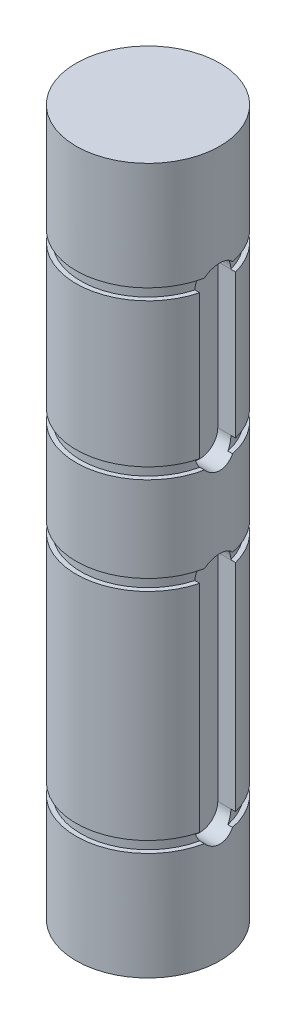
ISO-10303-21;
HEADER;
FILE_DESCRIPTION(('STEP AP214'),'2;1');
FILE_NAME('part.step','',(''),(''),'','','');
FILE_SCHEMA(('AUTOMOTIVE_DESIGN { 1 0 10303 214 1 1 1 1 }'));
ENDSEC;
DATA;
#1=APPLICATION_CONTEXT('core data for automotive mechanical design processes');
#2=APPLICATION_PROTOCOL_DEFINITION('international standard','automotive_design',2000,#1);
#3=PRODUCT_CONTEXT('',#1,'mechanical');
#4=PRODUCT('Part','Part','',(#3));
#5=PRODUCT_RELATED_PRODUCT_CATEGORY('part','',(#4));
#6=PRODUCT_DEFINITION_FORMATION('','',#4);
#7=PRODUCT_DEFINITION_CONTEXT('part definition',#1,'design');
#8=PRODUCT_DEFINITION('design','',#6,#7);
#9=PRODUCT_DEFINITION_SHAPE('','',#8);
#10=(LENGTH_UNIT() NAMED_UNIT(*) SI_UNIT(.MILLI.,.METRE.));
#11=(NAMED_UNIT(*) PLANE_ANGLE_UNIT() SI_UNIT($,.RADIAN.));
#12=(NAMED_UNIT(*) SI_UNIT($,.STERADIAN.) SOLID_ANGLE_UNIT());
#13=UNCERTAINTY_MEASURE_WITH_UNIT(LENGTH_MEASURE(1.E-05),#10,'distance_accuracy_value','');
#14=(GEOMETRIC_REPRESENTATION_CONTEXT(3) GLOBAL_UNCERTAINTY_ASSIGNED_CONTEXT((#13)) GLOBAL_UNIT_ASSIGNED_CONTEXT((#10,
#11,#12)) REPRESENTATION_CONTEXT('',''));
#15=CARTESIAN_POINT('',(0.,0.,0.));
#16=DIRECTION('',(0.,0.,1.));
#17=DIRECTION('',(1.,0.,0.));
#18=AXIS2_PLACEMENT_3D('',#15,#16,#17);
#19=CARTESIAN_POINT('',(0.,62.3062,0.));
#20=DIRECTION('',(0.,-1.,0.));
#21=DIRECTION('',(0.,0.,-1.));
#22=AXIS2_PLACEMENT_3D('',#19,#20,#21);
#23=CYLINDRICAL_SURFACE('',#22,6.35);
#24=CARTESIAN_POINT('',(0.,51.7906,0.));
#25=DIRECTION('',(0.,-1.,0.));
#26=DIRECTION('',(0.,0.,-1.));
#27=AXIS2_PLACEMENT_3D('',#24,#25,#26);
#28=CIRCLE('',#27,6.35);
#29=CARTESIAN_POINT('',(6.14836106210428,51.7906,1.5875));
#30=VERTEX_POINT('',#29);
#31=CARTESIAN_POINT('',(6.14836106210428,51.7906,-1.5875));
#32=VERTEX_POINT('',#31);
#33=EDGE_CURVE('E368',#30,#32,#28,.T.);
#34=ORIENTED_EDGE('',*,*,#33,.T.);
#35=DIRECTION('',(0.,-1.,0.));
#36=VECTOR('',#35,1.);
#37=CARTESIAN_POINT('',(6.14836106210428,62.3062,-1.5875));
#38=LINE('',#37,#36);
#39=CARTESIAN_POINT('',(6.14836106210428,39.0906,-1.5875));
#40=VERTEX_POINT('',#39);
#41=EDGE_CURVE('E677',#32,#40,#38,.T.);
#42=ORIENTED_EDGE('',*,*,#41,.T.);
#43=CARTESIAN_POINT('',(0.,39.0906,0.));
#44=DIRECTION('',(0.,1.,0.));
#45=DIRECTION('',(0.,0.,1.));
#46=AXIS2_PLACEMENT_3D('',#43,#44,#45);
#47=CIRCLE('',#46,6.35);
#48=CARTESIAN_POINT('',(6.14836106210428,39.0906,1.5875));
#49=VERTEX_POINT('',#48);
#50=EDGE_CURVE('E364',#40,#49,#47,.T.);
#51=ORIENTED_EDGE('',*,*,#50,.T.);
#52=DIRECTION('',(0.,-1.,0.));
#53=VECTOR('',#52,1.);
#54=CARTESIAN_POINT('',(6.14836106210428,62.3062,1.5875));
#55=LINE('',#54,#53);
#56=EDGE_CURVE('E679',#49,#30,#55,.F.);
#57=ORIENTED_EDGE('',*,*,#56,.T.);
#58=EDGE_LOOP('',(#34,#42,#51,#57));
#59=FACE_BOUND('',#58,.T.);
#60=ADVANCED_FACE('F32',(#59),#23,.T.);
#61=CARTESIAN_POINT('',(0.,51.7906,30.9495405489973));
#62=DIRECTION('',(0.,-1.,0.));
#63=DIRECTION('',(0.,0.,-1.));
#64=AXIS2_PLACEMENT_3D('',#61,#62,#63);
#65=PLANE('',#64);
#66=CARTESIAN_POINT('',(0.,51.7906,0.));
#67=DIRECTION('',(0.,1.,0.));
#68=DIRECTION('',(0.,0.,1.));
#69=AXIS2_PLACEMENT_3D('',#66,#67,#68);
#70=CIRCLE('',#69,5.9436);
#71=CARTESIAN_POINT('',(5.72767184028555,51.7906,-1.5875));
#72=VERTEX_POINT('',#71);
#73=CARTESIAN_POINT('',(5.72767184028555,51.7906,1.5875));
#74=VERTEX_POINT('',#73);
#75=EDGE_CURVE('E375',#72,#74,#70,.T.);
#76=ORIENTED_EDGE('',*,*,#75,.F.);
#77=DIRECTION('',(1.,0.,0.));
#78=VECTOR('',#77,1.);
#79=CARTESIAN_POINT('',(4.572,51.7906,-1.5875));
#80=LINE('',#79,#78);
#81=EDGE_CURVE('E297',#72,#32,#80,.T.);
#82=ORIENTED_EDGE('',*,*,#81,.T.);
#83=ORIENTED_EDGE('',*,*,#33,.F.);
#84=DIRECTION('',(1.,0.,0.));
#85=VECTOR('',#84,1.);
#86=CARTESIAN_POINT('',(4.572,51.7906,1.5875));
#87=LINE('',#86,#85);
#88=EDGE_CURVE('E293',#74,#30,#87,.T.);
#89=ORIENTED_EDGE('',*,*,#88,.F.);
#90=EDGE_LOOP('',(#76,#82,#83,#89));
#91=FACE_BOUND('',#90,.T.);
#92=ADVANCED_FACE('F434',(#91),#65,.F.);
#93=CARTESIAN_POINT('',(0.,52.7812,30.9495405489973));
#94=DIRECTION('',(0.,1.,0.));
#95=DIRECTION('',(0.,0.,1.));
#96=AXIS2_PLACEMENT_3D('',#93,#94,#95);
#97=PLANE('',#96);
#98=CARTESIAN_POINT('',(0.,52.7812,0.));
#99=DIRECTION('',(0.,1.,0.));
#100=DIRECTION('',(0.,0.,1.));
#101=AXIS2_PLACEMENT_3D('',#98,#99,#100);
#102=CIRCLE('',#101,5.9436);
#103=CARTESIAN_POINT('',(5.81270273366874,52.7812,-1.24051114061906));
#104=VERTEX_POINT('',#103);
#105=CARTESIAN_POINT('',(5.81270273366874,52.7812,1.24051114061906));
#106=VERTEX_POINT('',#105);
#107=EDGE_CURVE('E363',#104,#106,#102,.T.);
#108=ORIENTED_EDGE('',*,*,#107,.T.);
#109=DIRECTION('',(1.,0.,0.));
#110=VECTOR('',#109,1.);
#111=CARTESIAN_POINT('',(4.572,52.7812,1.24051114061906));
#112=LINE('',#111,#110);
#113=CARTESIAN_POINT('',(6.22765060917839,52.7812,1.24051114061906));
#114=VERTEX_POINT('',#113);
#115=EDGE_CURVE('E666',#106,#114,#112,.T.);
#116=ORIENTED_EDGE('',*,*,#115,.T.);
#117=CARTESIAN_POINT('',(0.,52.7812,0.));
#118=DIRECTION('',(0.,1.,0.));
#119=DIRECTION('',(0.,0.,1.));
#120=AXIS2_PLACEMENT_3D('',#117,#118,#119);
#121=CIRCLE('',#120,6.35);
#122=CARTESIAN_POINT('',(6.22765060917839,52.7812,-1.24051114061906));
#123=VERTEX_POINT('',#122);
#124=EDGE_CURVE('E372',#123,#114,#121,.T.);
#125=ORIENTED_EDGE('',*,*,#124,.F.);
#126=DIRECTION('',(1.,0.,0.));
#127=VECTOR('',#126,1.);
#128=CARTESIAN_POINT('',(4.572,52.7812,-1.24051114061906));
#129=LINE('',#128,#127);
#130=EDGE_CURVE('E667',#123,#104,#129,.F.);
#131=ORIENTED_EDGE('',*,*,#130,.T.);
#132=EDGE_LOOP('',(#108,#116,#125,#131));
#133=FACE_BOUND('',#132,.T.);
#134=ADVANCED_FACE('F440',(#133),#97,.F.);
#135=CARTESIAN_POINT('',(0.,57.3479735584588,0.));
#136=DIRECTION('',(0.,1.,0.));
#137=DIRECTION('',(0.,0.,1.));
#138=AXIS2_PLACEMENT_3D('',#135,#136,#137);
#139=CYLINDRICAL_SURFACE('',#138,5.9436);
#140=ORIENTED_EDGE('',*,*,#75,.T.);
#141=CARTESIAN_POINT('',(5.72767184028555,51.7906,1.5875));
#142=CARTESIAN_POINT('',(5.72766804610027,51.8349788866214,1.58750194805808));
#143=CARTESIAN_POINT('',(5.72818813422054,51.8793382686311,1.58563830137082));
#144=CARTESIAN_POINT('',(5.73024000478097,51.967712391909,1.57821195212509));
#145=CARTESIAN_POINT('',(5.73177154850907,52.0117272120172,1.57265012236694));
#146=CARTESIAN_POINT('',(5.73771384551916,52.1403217209515,1.55088835422927));
#147=CARTESIAN_POINT('',(5.74347777277273,52.2240289517323,1.52960258418085));
#148=CARTESIAN_POINT('',(5.75836292111803,52.3903481785974,1.47259415694831));
#149=CARTESIAN_POINT('',(5.76762462415825,52.4727380974612,1.43626019797557));
#150=CARTESIAN_POINT('',(5.78329806159334,52.5918087718749,1.37126100174845));
#151=CARTESIAN_POINT('',(5.78891663315768,52.6312960658287,1.34740876355262));
#152=CARTESIAN_POINT('',(5.80055334186276,52.7080038913665,1.29639711833931));
#153=CARTESIAN_POINT('',(5.80657142646175,52.7452247197941,1.26923814581491));
#154=CARTESIAN_POINT('',(5.81270273366874,52.7812,1.24051114061906));
#155=B_SPLINE_CURVE_WITH_KNOTS('',3,(#141,#142,#143,#144,#145,#146,#147,#148,#149,#150,#151,
#152,#153,#154),.UNSPECIFIED.,.F.,.F.,(4,2,2,2,2,2,4),(0.,0.13305635000978,0.266081308813883,
0.524501760701662,0.794649138064695,0.933915485774882,1.07316355409293),.UNSPECIFIED.);
#156=EDGE_CURVE('E397',#74,#106,#155,.T.);
#157=ORIENTED_EDGE('',*,*,#156,.T.);
#158=ORIENTED_EDGE('',*,*,#107,.F.);
#159=CARTESIAN_POINT('',(5.81270273366874,52.7812,-1.24051114061906));
#160=CARTESIAN_POINT('',(5.80676093223229,52.74633733761,-1.26835031027519));
#161=CARTESIAN_POINT('',(5.8009253407225,52.7103032972455,-1.29471734166642));
#162=CARTESIAN_POINT('',(5.78962448943313,52.636101088542,-1.34435038702208));
#163=CARTESIAN_POINT('',(5.78415925642407,52.5979327662943,-1.36761617693749));
#164=CARTESIAN_POINT('',(5.76886044428707,52.4828281402528,-1.43125963250244));
#165=CARTESIAN_POINT('',(5.75975979338478,52.403231861975,-1.46711930717738));
#166=CARTESIAN_POINT('',(5.74448324543573,52.2375483974185,-1.52585859113951));
#167=CARTESIAN_POINT('',(5.73835992335598,52.151373607262,-1.54850619216327));
#168=CARTESIAN_POINT('',(5.73203917642506,52.0188296974734,-1.57167662157916));
#169=CARTESIAN_POINT('',(5.73040804690453,51.9734147554939,-1.57760264372825));
#170=CARTESIAN_POINT('',(5.72822216727329,51.8822074368184,-1.58551566901053));
#171=CARTESIAN_POINT('',(5.72766765395878,51.8364149793135,-1.58750180558824));
#172=CARTESIAN_POINT('',(5.72767184028555,51.7906,-1.5875));
#173=B_SPLINE_CURVE_WITH_KNOTS('',3,(#159,#160,#161,#162,#163,#164,#165,#166,#167,#168,#169,
#170,#171,#172),.UNSPECIFIED.,.F.,.F.,(4,2,2,2,2,2,4),(0.,0.13494965007682,0.269909044305552,
0.531960547427966,0.798485077464079,0.935809383428473,1.07316388974744),.UNSPECIFIED.);
#174=EDGE_CURVE('E404',#104,#72,#173,.T.);
#175=ORIENTED_EDGE('',*,*,#174,.T.);
#176=EDGE_LOOP('',(#140,#157,#158,#175));
#177=FACE_BOUND('',#176,.T.);
#178=ADVANCED_FACE('F409',(#177),#139,.T.);
#179=CARTESIAN_POINT('',(0.,62.3062,0.));
#180=DIRECTION('',(0.,1.,0.));
#181=DIRECTION('',(0.,0.,1.));
#182=AXIS2_PLACEMENT_3D('',#179,#180,#181);
#183=PLANE('',#182);
#184=CARTESIAN_POINT('',(0.,62.3062,0.));
#185=DIRECTION('',(0.,1.,0.));
#186=DIRECTION('',(0.,0.,1.));
#187=AXIS2_PLACEMENT_3D('',#184,#185,#186);
#188=CIRCLE('',#187,6.35);
#189=CARTESIAN_POINT('',(0.,62.3062,6.35));
#190=VERTEX_POINT('',#189);
#191=EDGE_CURVE('E343',#190,#190,#188,.T.);
#192=ORIENTED_EDGE('',*,*,#191,.T.);
#193=EDGE_LOOP('',(#192));
#194=FACE_BOUND('',#193,.T.);
#195=ADVANCED_FACE('F444',(#194),#183,.T.);
#196=ORIENTED_EDGE('',*,*,#124,.T.);
#197=CARTESIAN_POINT('',(6.22765060917839,52.7812,1.24051114061906));
#198=CARTESIAN_POINT('',(6.23320783945382,52.8161378215592,1.2126102393573));
#199=CARTESIAN_POINT('',(6.23886039060933,52.8498712636352,1.18325559981259));
#200=CARTESIAN_POINT('',(6.25020149422038,52.914741606585,1.12181126216662));
#201=CARTESIAN_POINT('',(6.25589004691655,52.9458784900839,1.08972154576646));
#202=CARTESIAN_POINT('',(6.2727722846694,53.0350837099081,0.989640681923259));
#203=CARTESIAN_POINT('',(6.28378811857192,53.0889801382244,0.917811004237603));
#204=CARTESIAN_POINT('',(6.3041083179383,53.1840151207872,0.76589422656221));
#205=CARTESIAN_POINT('',(6.31341126157692,53.22514309553,0.685800351954511));
#206=CARTESIAN_POINT('',(6.32925406928647,53.2933365380244,0.519609689028027));
#207=CARTESIAN_POINT('',(6.33579564411446,53.3204107149522,0.433516656017836));
#208=CARTESIAN_POINT('',(6.34529454604823,53.3592846308184,0.259270320083067));
#209=CARTESIAN_POINT('',(6.34830987825246,53.3713317849185,0.171175393891068));
#210=CARTESIAN_POINT('',(6.35061397512241,53.3805608892268,-0.00584854805473896));
#211=CARTESIAN_POINT('',(6.34990259861925,53.377742276315,-0.0947775952779393));
#212=CARTESIAN_POINT('',(6.34488868818956,53.3575583908652,-0.268922050286359));
#213=CARTESIAN_POINT('',(6.34066327595629,53.340505485485,-0.354176205390172));
#214=CARTESIAN_POINT('',(6.32917385599744,53.2928081997939,-0.520596366331578));
#215=CARTESIAN_POINT('',(6.32190904766935,53.2621602383026,-0.601761288714857));
#216=CARTESIAN_POINT('',(6.30501409455029,53.1878048506769,-0.75868455861302));
#217=CARTESIAN_POINT('',(6.2953588178793,53.1439575225197,-0.834373638215742));
#218=CARTESIAN_POINT('',(6.27474734999086,53.0445771479035,-0.977374398357573));
#219=CARTESIAN_POINT('',(6.26379263841329,52.98905733804,-1.04469543181984));
#220=CARTESIAN_POINT('',(6.24855866645397,52.9053466372952,-1.13075323727132));
#221=CARTESIAN_POINT('',(6.24433654135724,52.8814629829803,-1.15381013700283));
#222=CARTESIAN_POINT('',(6.23594250238016,52.8323387160929,-1.19834525875783));
#223=CARTESIAN_POINT('',(6.2317705110774,52.8071006532646,-1.21982627860311));
#224=CARTESIAN_POINT('',(6.22765060917839,52.7812,-1.24051114061906));
#225=B_SPLINE_CURVE_WITH_KNOTS('',3,(#197,#198,#199,#200,#201,#202,#203,#204,#205,#206,#207,
#208,#209,#210,#211,#212,#213,#214,#215,#216,#217,#218,#219,#220,#221,#222,#223,#224),
.UNSPECIFIED.,.F.,.F.,(4,2,2,2,2,2,2,2,2,2,2,2,2,4),(0.,0.13508328392132,0.270167471681551,
0.540207610771843,0.810470902383514,1.08056651055367,1.34615372554164,1.61175100112949,
1.87166851811821,2.13165454271635,2.39449949657434,2.65704797661509,2.75739135215893,
2.8575520354902),.UNSPECIFIED.);
#226=EDGE_CURVE('E248',#114,#123,#225,.T.);
#227=ORIENTED_EDGE('',*,*,#226,.T.);
#228=EDGE_LOOP('',(#196,#227));
#229=FACE_BOUND('',#228,.T.);
#230=ORIENTED_EDGE('',*,*,#191,.F.);
#231=EDGE_LOOP('',(#230));
#232=FACE_BOUND('',#231,.T.);
#233=ADVANCED_FACE('F34',(#229,#232),#23,.T.);
#234=CARTESIAN_POINT('',(0.,38.1,29.4897754611827));
#235=DIRECTION('',(0.,-1.,0.));
#236=DIRECTION('',(0.,0.,-1.));
#237=AXIS2_PLACEMENT_3D('',#234,#235,#236);
#238=PLANE('',#237);
#239=CARTESIAN_POINT('',(0.,38.1,0.));
#240=DIRECTION('',(0.,1.,0.));
#241=DIRECTION('',(0.,0.,1.));
#242=AXIS2_PLACEMENT_3D('',#239,#240,#241);
#243=CIRCLE('',#242,5.9436);
#244=CARTESIAN_POINT('',(5.81270273366874,38.1,-1.24051114061906));
#245=VERTEX_POINT('',#244);
#246=CARTESIAN_POINT('',(5.81270273366874,38.1,1.24051114061906));
#247=VERTEX_POINT('',#246);
#248=EDGE_CURVE('E367',#245,#247,#243,.T.);
#249=ORIENTED_EDGE('',*,*,#248,.F.);
#250=DIRECTION('',(1.,0.,0.));
#251=VECTOR('',#250,1.);
#252=CARTESIAN_POINT('',(4.572,38.1,-1.24051114061906));
#253=LINE('',#252,#251);
#254=CARTESIAN_POINT('',(6.22765060917839,38.1,-1.24051114061906));
#255=VERTEX_POINT('',#254);
#256=EDGE_CURVE('E310',#245,#255,#253,.T.);
#257=ORIENTED_EDGE('',*,*,#256,.T.);
#258=CARTESIAN_POINT('',(0.,38.1,0.));
#259=DIRECTION('',(0.,-1.,0.));
#260=DIRECTION('',(0.,0.,-1.));
#261=AXIS2_PLACEMENT_3D('',#258,#259,#260);
#262=CIRCLE('',#261,6.35);
#263=CARTESIAN_POINT('',(6.22765060917839,38.1,1.24051114061906));
#264=VERTEX_POINT('',#263);
#265=EDGE_CURVE('E360',#264,#255,#262,.T.);
#266=ORIENTED_EDGE('',*,*,#265,.F.);
#267=DIRECTION('',(1.,0.,0.));
#268=VECTOR('',#267,1.);
#269=CARTESIAN_POINT('',(4.572,38.1,1.24051114061906));
#270=LINE('',#269,#268);
#271=EDGE_CURVE('E61',#264,#247,#270,.F.);
#272=ORIENTED_EDGE('',*,*,#271,.T.);
#273=EDGE_LOOP('',(#249,#257,#266,#272));
#274=FACE_BOUND('',#273,.T.);
#275=ADVANCED_FACE('F443',(#274),#238,.F.);
#276=CARTESIAN_POINT('',(0.,39.0906,29.4897754611827));
#277=DIRECTION('',(0.,1.,0.));
#278=DIRECTION('',(0.,0.,1.));
#279=AXIS2_PLACEMENT_3D('',#276,#277,#278);
#280=PLANE('',#279);
#281=ORIENTED_EDGE('',*,*,#50,.F.);
#282=DIRECTION('',(1.,0.,0.));
#283=VECTOR('',#282,1.);
#284=CARTESIAN_POINT('',(4.572,39.0906,-1.5875));
#285=LINE('',#284,#283);
#286=CARTESIAN_POINT('',(5.72767184028555,39.0906,-1.5875));
#287=VERTEX_POINT('',#286);
#288=EDGE_CURVE('E301',#287,#40,#285,.T.);
#289=ORIENTED_EDGE('',*,*,#288,.F.);
#290=CARTESIAN_POINT('',(0.,39.0906,0.));
#291=DIRECTION('',(0.,1.,0.));
#292=DIRECTION('',(0.,0.,1.));
#293=AXIS2_PLACEMENT_3D('',#290,#291,#292);
#294=CIRCLE('',#293,5.9436);
#295=CARTESIAN_POINT('',(5.72767184028555,39.0906,1.5875));
#296=VERTEX_POINT('',#295);
#297=EDGE_CURVE('E355',#287,#296,#294,.T.);
#298=ORIENTED_EDGE('',*,*,#297,.T.);
#299=DIRECTION('',(1.,0.,0.));
#300=VECTOR('',#299,1.);
#301=CARTESIAN_POINT('',(4.572,39.0906,1.5875));
#302=LINE('',#301,#300);
#303=EDGE_CURVE('E305',#296,#49,#302,.T.);
#304=ORIENTED_EDGE('',*,*,#303,.T.);
#305=EDGE_LOOP('',(#281,#289,#298,#304));
#306=FACE_BOUND('',#305,.T.);
#307=ADVANCED_FACE('F455',(#306),#280,.F.);
#308=CARTESIAN_POINT('',(0.,44.8930496120412,0.));
#309=DIRECTION('',(0.,1.,0.));
#310=DIRECTION('',(0.,0.,1.));
#311=AXIS2_PLACEMENT_3D('',#308,#309,#310);
#312=CYLINDRICAL_SURFACE('',#311,5.9436);
#313=ORIENTED_EDGE('',*,*,#248,.T.);
#314=CARTESIAN_POINT('',(5.81270273366874,38.1,1.24051114061906));
#315=CARTESIAN_POINT('',(5.80676093223229,38.13486266239,1.26835031027519));
#316=CARTESIAN_POINT('',(5.8009253407225,38.1708967027545,1.29471734166642));
#317=CARTESIAN_POINT('',(5.78962448943313,38.245098911458,1.34435038702208));
#318=CARTESIAN_POINT('',(5.78415925642407,38.2832672337057,1.36761617693749));
#319=CARTESIAN_POINT('',(5.76886044428707,38.3983718597472,1.43125963250244));
#320=CARTESIAN_POINT('',(5.75975979338478,38.477968138025,1.46711930717738));
#321=CARTESIAN_POINT('',(5.74448324543573,38.6436516025815,1.52585859113951));
#322=CARTESIAN_POINT('',(5.73835992335598,38.7298263927379,1.54850619216327));
#323=CARTESIAN_POINT('',(5.73203917642507,38.8623703025266,1.57167662157916));
#324=CARTESIAN_POINT('',(5.73040804690453,38.9077852445061,1.57760264372825));
#325=CARTESIAN_POINT('',(5.72822216727329,38.9989925631815,1.58551566901053));
#326=CARTESIAN_POINT('',(5.72766765395878,39.0447850206865,1.58750180558824));
#327=CARTESIAN_POINT('',(5.72767184028555,39.0906,1.5875));
#328=B_SPLINE_CURVE_WITH_KNOTS('',3,(#314,#315,#316,#317,#318,#319,#320,#321,#322,#323,#324,
#325,#326,#327),.UNSPECIFIED.,.F.,.F.,(4,2,2,2,2,2,4),(0.,0.13494965007682,0.269909044305552,
0.531960547427966,0.798485077464079,0.935809383428466,1.07316388974744),.UNSPECIFIED.);
#329=EDGE_CURVE('E321',#247,#296,#328,.T.);
#330=ORIENTED_EDGE('',*,*,#329,.T.);
#331=ORIENTED_EDGE('',*,*,#297,.F.);
#332=CARTESIAN_POINT('',(5.72767184028555,39.0906,-1.5875));
#333=CARTESIAN_POINT('',(5.72766804610027,39.0462211133786,-1.58750194805808));
#334=CARTESIAN_POINT('',(5.72818813422054,39.0018617313689,-1.58563830137082));
#335=CARTESIAN_POINT('',(5.73024000478097,38.913487608091,-1.57821195212509));
#336=CARTESIAN_POINT('',(5.73177154850907,38.8694727879827,-1.57265012236694));
#337=CARTESIAN_POINT('',(5.73771384551916,38.7408782790485,-1.55088835422927));
#338=CARTESIAN_POINT('',(5.74347777277273,38.6571710482677,-1.52960258418085));
#339=CARTESIAN_POINT('',(5.75836292111803,38.4908518214025,-1.47259415694831));
#340=CARTESIAN_POINT('',(5.76762462415825,38.4084619025388,-1.43626019797557));
#341=CARTESIAN_POINT('',(5.78329806159334,38.2893912281251,-1.37126100174845));
#342=CARTESIAN_POINT('',(5.78891663315769,38.2499039341713,-1.34740876355262));
#343=CARTESIAN_POINT('',(5.80055334186276,38.1731961086335,-1.29639711833931));
#344=CARTESIAN_POINT('',(5.80657142646176,38.1359752802059,-1.26923814581491));
#345=CARTESIAN_POINT('',(5.81270273366874,38.1,-1.24051114061906));
#346=B_SPLINE_CURVE_WITH_KNOTS('',3,(#332,#333,#334,#335,#336,#337,#338,#339,#340,#341,#342,
#343,#344,#345),.UNSPECIFIED.,.F.,.F.,(4,2,2,2,2,2,4),(0.,0.13305635000978,0.266081308813883,
0.524501760701662,0.794649138064695,0.933915485774882,1.07316355409293),.UNSPECIFIED.);
#347=EDGE_CURVE('E313',#287,#245,#346,.T.);
#348=ORIENTED_EDGE('',*,*,#347,.T.);
#349=EDGE_LOOP('',(#313,#330,#331,#348));
#350=FACE_BOUND('',#349,.T.);
#351=ADVANCED_FACE('F326',(#350),#312,.T.);
#352=CARTESIAN_POINT('',(0.,30.5562,0.));
#353=DIRECTION('',(0.,1.,0.));
#354=DIRECTION('',(0.,0.,1.));
#355=AXIS2_PLACEMENT_3D('',#352,#353,#354);
#356=CIRCLE('',#355,6.35);
#357=CARTESIAN_POINT('',(6.2276506091784,30.5562,-1.24051114061906));
#358=VERTEX_POINT('',#357);
#359=CARTESIAN_POINT('',(6.2276506091784,30.5562,1.24051114061905));
#360=VERTEX_POINT('',#359);
#361=EDGE_CURVE('E356',#358,#360,#356,.T.);
#362=ORIENTED_EDGE('',*,*,#361,.T.);
#363=CARTESIAN_POINT('',(6.2276506091784,30.5562,1.24051114061905));
#364=CARTESIAN_POINT('',(6.23320783945382,30.5911378215592,1.21261023935729));
#365=CARTESIAN_POINT('',(6.23886039060933,30.6248712636352,1.18325559981258));
#366=CARTESIAN_POINT('',(6.25020149422039,30.689741606585,1.12181126216661));
#367=CARTESIAN_POINT('',(6.25589004691655,30.7208784900839,1.08972154576645));
#368=CARTESIAN_POINT('',(6.2727722846694,30.8100837099081,0.989640681923253));
#369=CARTESIAN_POINT('',(6.28378811857192,30.8639801382244,0.917811004237598));
#370=CARTESIAN_POINT('',(6.3041083179383,30.9590151207872,0.765894226562205));
#371=CARTESIAN_POINT('',(6.31341126157692,31.00014309553,0.685800351954505));
#372=CARTESIAN_POINT('',(6.32925406928647,31.0683365380244,0.519609689028021));
#373=CARTESIAN_POINT('',(6.33579564411446,31.0954107149522,0.43351665601783));
#374=CARTESIAN_POINT('',(6.34529454604823,31.1342846308184,0.259270320083061));
#375=CARTESIAN_POINT('',(6.34830987825246,31.1463317849185,0.171175393891061));
#376=CARTESIAN_POINT('',(6.35061397512241,31.1555608892268,-0.00584854805474554));
#377=CARTESIAN_POINT('',(6.34990259861925,31.152742276315,-0.0947775952779453));
#378=CARTESIAN_POINT('',(6.34488868818956,31.1325583908652,-0.268922050286364));
#379=CARTESIAN_POINT('',(6.3406632759563,31.115505485485,-0.354176205390177));
#380=CARTESIAN_POINT('',(6.32917385599744,31.0678081997939,-0.520596366331583));
#381=CARTESIAN_POINT('',(6.32190904766935,31.0371602383026,-0.601761288714861));
#382=CARTESIAN_POINT('',(6.30501409455029,30.9628048506769,-0.758684558613023));
#383=CARTESIAN_POINT('',(6.2953588178793,30.9189575225197,-0.834373638215743));
#384=CARTESIAN_POINT('',(6.27474734999086,30.8195771479035,-0.977374398357576));
#385=CARTESIAN_POINT('',(6.26379263841329,30.76405733804,-1.04469543181985));
#386=CARTESIAN_POINT('',(6.24855866645397,30.6803466372952,-1.13075323727132));
#387=CARTESIAN_POINT('',(6.24433654135724,30.6564629829803,-1.15381013700283));
#388=CARTESIAN_POINT('',(6.23594250238016,30.6073387160929,-1.19834525875782));
#389=CARTESIAN_POINT('',(6.23177051107741,30.5821006532646,-1.21982627860311));
#390=CARTESIAN_POINT('',(6.2276506091784,30.5562,-1.24051114061905));
#391=B_SPLINE_CURVE_WITH_KNOTS('',3,(#363,#364,#365,#366,#367,#368,#369,#370,#371,#372,#373,
#374,#375,#376,#377,#378,#379,#380,#381,#382,#383,#384,#385,#386,#387,#388,#389,#390),
.UNSPECIFIED.,.F.,.F.,(4,2,2,2,2,2,2,2,2,2,2,2,2,4),(0.,0.13508328392132,0.270167471681552,
0.54020761077184,0.810470902383512,1.08056651055366,1.34615372554164,1.61175100112949,
1.8716685181182,2.13165454271634,2.39449949657433,2.65704797661508,2.75739135215892,
2.85755203549018),.UNSPECIFIED.);
#392=EDGE_CURVE('E270',#360,#358,#391,.T.);
#393=ORIENTED_EDGE('',*,*,#392,.T.);
#394=EDGE_LOOP('',(#362,#393));
#395=FACE_BOUND('',#394,.T.);
#396=ORIENTED_EDGE('',*,*,#265,.T.);
#397=CARTESIAN_POINT('',(6.22765060917839,38.1,-1.24051114061906));
#398=CARTESIAN_POINT('',(6.23320783945382,38.0650621784408,-1.2126102393573));
#399=CARTESIAN_POINT('',(6.23886039060933,38.0313287363647,-1.18325559981259));
#400=CARTESIAN_POINT('',(6.25020149422038,37.9664583934149,-1.12181126216662));
#401=CARTESIAN_POINT('',(6.25589004691655,37.9353215099161,-1.08972154576646));
#402=CARTESIAN_POINT('',(6.2727722846694,37.8461162900919,-0.989640681923259));
#403=CARTESIAN_POINT('',(6.28378811857192,37.7922198617755,-0.917811004237603));
#404=CARTESIAN_POINT('',(6.3041083179383,37.6971848792128,-0.76589422656221));
#405=CARTESIAN_POINT('',(6.31341126157692,37.6560569044699,-0.685800351954511));
#406=CARTESIAN_POINT('',(6.32925406928647,37.5878634619756,-0.519609689028027));
#407=CARTESIAN_POINT('',(6.33579564411446,37.5607892850477,-0.433516656017836));
#408=CARTESIAN_POINT('',(6.34529454604823,37.5219153691816,-0.259270320083067));
#409=CARTESIAN_POINT('',(6.34830987825246,37.5098682150815,-0.171175393891068));
#410=CARTESIAN_POINT('',(6.35061397512241,37.5006391107732,0.00584854805473896));
#411=CARTESIAN_POINT('',(6.34990259861925,37.503457723685,0.0947775952779393));
#412=CARTESIAN_POINT('',(6.34488868818956,37.5236416091347,0.268922050286359));
#413=CARTESIAN_POINT('',(6.34066327595629,37.540694514515,0.354176205390172));
#414=CARTESIAN_POINT('',(6.32917385599744,37.5883918002061,0.520596366331578));
#415=CARTESIAN_POINT('',(6.32190904766935,37.6190397616974,0.601761288714857));
#416=CARTESIAN_POINT('',(6.30501409455029,37.6933951493231,0.75868455861302));
#417=CARTESIAN_POINT('',(6.2953588178793,37.7372424774803,0.834373638215742));
#418=CARTESIAN_POINT('',(6.27474734999086,37.8366228520964,0.977374398357573));
#419=CARTESIAN_POINT('',(6.26379263841329,37.89214266196,1.04469543181984));
#420=CARTESIAN_POINT('',(6.24855866645397,37.9758533627048,1.13075323727132));
#421=CARTESIAN_POINT('',(6.24433654135724,37.9997370170197,1.15381013700283));
#422=CARTESIAN_POINT('',(6.23594250238016,38.0488612839071,1.19834525875783));
#423=CARTESIAN_POINT('',(6.2317705110774,38.0740993467353,1.21982627860311));
#424=CARTESIAN_POINT('',(6.22765060917839,38.1,1.24051114061906));
#425=B_SPLINE_CURVE_WITH_KNOTS('',3,(#397,#398,#399,#400,#401,#402,#403,#404,#405,#406,#407,
#408,#409,#410,#411,#412,#413,#414,#415,#416,#417,#418,#419,#420,#421,#422,#423,#424),
.UNSPECIFIED.,.F.,.F.,(4,2,2,2,2,2,2,2,2,2,2,2,2,4),(0.,0.13508328392132,0.270167471681551,
0.540207610771843,0.810470902383514,1.08056651055367,1.34615372554164,1.61175100112949,
1.87166851811821,2.13165454271635,2.39449949657434,2.65704797661509,2.75739135215893,
2.8575520354902),.UNSPECIFIED.);
#426=EDGE_CURVE('E338',#255,#264,#425,.T.);
#427=ORIENTED_EDGE('',*,*,#426,.T.);
#428=EDGE_LOOP('',(#396,#427));
#429=FACE_BOUND('',#428,.T.);
#430=ADVANCED_FACE('F436',(#395,#429),#23,.T.);
#431=CARTESIAN_POINT('',(0.,29.5656,24.6019803533965));
#432=DIRECTION('',(0.,-1.,0.));
#433=DIRECTION('',(0.,0.,-1.));
#434=AXIS2_PLACEMENT_3D('',#431,#432,#433);
#435=PLANE('',#434);
#436=CARTESIAN_POINT('',(0.,29.5656,0.));
#437=DIRECTION('',(0.,1.,0.));
#438=DIRECTION('',(0.,0.,1.));
#439=AXIS2_PLACEMENT_3D('',#436,#437,#438);
#440=CIRCLE('',#439,5.9436);
#441=CARTESIAN_POINT('',(5.72767184028555,29.5656,-1.5875));
#442=VERTEX_POINT('',#441);
#443=CARTESIAN_POINT('',(5.72767184028555,29.5656,1.5875));
#444=VERTEX_POINT('',#443);
#445=EDGE_CURVE('E359',#442,#444,#440,.T.);
#446=ORIENTED_EDGE('',*,*,#445,.F.);
#447=DIRECTION('',(1.,0.,0.));
#448=VECTOR('',#447,1.);
#449=CARTESIAN_POINT('',(4.572,29.5656,-1.5875));
#450=LINE('',#449,#448);
#451=CARTESIAN_POINT('',(6.14836106210428,29.5656,-1.5875));
#452=VERTEX_POINT('',#451);
#453=EDGE_CURVE('E206',#442,#452,#450,.T.);
#454=ORIENTED_EDGE('',*,*,#453,.T.);
#455=CARTESIAN_POINT('',(0.,29.5656,0.));
#456=DIRECTION('',(0.,-1.,0.));
#457=DIRECTION('',(0.,0.,-1.));
#458=AXIS2_PLACEMENT_3D('',#455,#456,#457);
#459=CIRCLE('',#458,6.35);
#460=CARTESIAN_POINT('',(6.14836106210428,29.5656,1.5875));
#461=VERTEX_POINT('',#460);
#462=EDGE_CURVE('E352',#461,#452,#459,.T.);
#463=ORIENTED_EDGE('',*,*,#462,.F.);
#464=DIRECTION('',(1.,0.,0.));
#465=VECTOR('',#464,1.);
#466=CARTESIAN_POINT('',(4.572,29.5656,1.5875));
#467=LINE('',#466,#465);
#468=EDGE_CURVE('E185',#444,#461,#467,.T.);
#469=ORIENTED_EDGE('',*,*,#468,.F.);
#470=EDGE_LOOP('',(#446,#454,#463,#469));
#471=FACE_BOUND('',#470,.T.);
#472=ADVANCED_FACE('F447',(#471),#435,.F.);
#473=CARTESIAN_POINT('',(0.,30.5562,24.6019803533965));
#474=DIRECTION('',(0.,1.,0.));
#475=DIRECTION('',(0.,0.,1.));
#476=AXIS2_PLACEMENT_3D('',#473,#474,#475);
#477=PLANE('',#476);
#478=CARTESIAN_POINT('',(0.,30.5562,0.));
#479=DIRECTION('',(0.,1.,0.));
#480=DIRECTION('',(0.,0.,1.));
#481=AXIS2_PLACEMENT_3D('',#478,#479,#480);
#482=CIRCLE('',#481,5.9436);
#483=CARTESIAN_POINT('',(5.81270273366874,30.5562,-1.24051114061906));
#484=VERTEX_POINT('',#483);
#485=CARTESIAN_POINT('',(5.81270273366874,30.5562,1.24051114061906));
#486=VERTEX_POINT('',#485);
#487=EDGE_CURVE('E347',#484,#486,#482,.T.);
#488=ORIENTED_EDGE('',*,*,#487,.T.);
#489=DIRECTION('',(1.,0.,0.));
#490=VECTOR('',#489,1.);
#491=CARTESIAN_POINT('',(4.572,30.5562,1.24051114061906));
#492=LINE('',#491,#490);
#493=EDGE_CURVE('E276',#486,#360,#492,.T.);
#494=ORIENTED_EDGE('',*,*,#493,.T.);
#495=ORIENTED_EDGE('',*,*,#361,.F.);
#496=DIRECTION('',(1.,0.,0.));
#497=VECTOR('',#496,1.);
#498=CARTESIAN_POINT('',(4.572,30.5562,-1.24051114061906));
#499=LINE('',#498,#497);
#500=EDGE_CURVE('E277',#358,#484,#499,.F.);
#501=ORIENTED_EDGE('',*,*,#500,.T.);
#502=EDGE_LOOP('',(#488,#494,#495,#501));
#503=FACE_BOUND('',#502,.T.);
#504=ADVANCED_FACE('F453',(#503),#477,.F.);
#505=CARTESIAN_POINT('',(0.,32.8864053583283,0.));
#506=DIRECTION('',(0.,1.,0.));
#507=DIRECTION('',(0.,0.,1.));
#508=AXIS2_PLACEMENT_3D('',#505,#506,#507);
#509=CYLINDRICAL_SURFACE('',#508,5.9436);
#510=ORIENTED_EDGE('',*,*,#445,.T.);
#511=CARTESIAN_POINT('',(5.72767184028555,29.5656,1.5875));
#512=CARTESIAN_POINT('',(5.72766804610027,29.6099788866214,1.58750194805808));
#513=CARTESIAN_POINT('',(5.72818813422054,29.6543382686311,1.58563830137082));
#514=CARTESIAN_POINT('',(5.73024000478097,29.742712391909,1.57821195212509));
#515=CARTESIAN_POINT('',(5.73177154850907,29.7867272120172,1.57265012236694));
#516=CARTESIAN_POINT('',(5.73771384551916,29.9153217209515,1.55088835422927));
#517=CARTESIAN_POINT('',(5.74347777277273,29.9990289517323,1.52960258418085));
#518=CARTESIAN_POINT('',(5.75836292111804,30.1653481785974,1.47259415694831));
#519=CARTESIAN_POINT('',(5.76762462415825,30.2477380974612,1.43626019797556));
#520=CARTESIAN_POINT('',(5.78329806159334,30.3668087718749,1.37126100174845));
#521=CARTESIAN_POINT('',(5.78891663315768,30.4062960658287,1.34740876355262));
#522=CARTESIAN_POINT('',(5.80055334186276,30.4830038913665,1.29639711833931));
#523=CARTESIAN_POINT('',(5.80657142646175,30.5202247197941,1.26923814581491));
#524=CARTESIAN_POINT('',(5.81270273366874,30.5562,1.24051114061906));
#525=B_SPLINE_CURVE_WITH_KNOTS('',3,(#511,#512,#513,#514,#515,#516,#517,#518,#519,#520,#521,
#522,#523,#524),.UNSPECIFIED.,.F.,.F.,(4,2,2,2,2,2,4),(0.,0.133056350009787,0.26608130881389,
0.524501760701663,0.7946491380647,0.933915485774885,1.07316355409294),.UNSPECIFIED.);
#526=EDGE_CURVE('E11',#444,#486,#525,.T.);
#527=ORIENTED_EDGE('',*,*,#526,.T.);
#528=ORIENTED_EDGE('',*,*,#487,.F.);
#529=CARTESIAN_POINT('',(5.81270273366874,30.5562,-1.24051114061906));
#530=CARTESIAN_POINT('',(5.80676093223229,30.52133733761,-1.26835031027518));
#531=CARTESIAN_POINT('',(5.8009253407225,30.4853032972455,-1.29471734166641));
#532=CARTESIAN_POINT('',(5.78962448943313,30.4111010885419,-1.34435038702208));
#533=CARTESIAN_POINT('',(5.78415925642407,30.3729327662943,-1.36761617693749));
#534=CARTESIAN_POINT('',(5.76886044428707,30.2578281402527,-1.43125963250244));
#535=CARTESIAN_POINT('',(5.75975979338478,30.178231861975,-1.46711930717738));
#536=CARTESIAN_POINT('',(5.74448324543573,30.0125483974184,-1.52585859113951));
#537=CARTESIAN_POINT('',(5.73835992335598,29.926373607262,-1.54850619216327));
#538=CARTESIAN_POINT('',(5.73203917642506,29.7938296974734,-1.57167662157916));
#539=CARTESIAN_POINT('',(5.73040804690453,29.7484147554939,-1.57760264372825));
#540=CARTESIAN_POINT('',(5.72822216727329,29.6572074368184,-1.58551566901053));
#541=CARTESIAN_POINT('',(5.72766765395878,29.6114149793135,-1.58750180558824));
#542=CARTESIAN_POINT('',(5.72767184028555,29.5656,-1.5875));
#543=B_SPLINE_CURVE_WITH_KNOTS('',3,(#529,#530,#531,#532,#533,#534,#535,#536,#537,#538,#539,
#540,#541,#542),.UNSPECIFIED.,.F.,.F.,(4,2,2,2,2,2,4),(0.,0.134949650076821,0.269909044305564,
0.531960547427978,0.798485077464084,0.935809383428473,1.07316388974743),.UNSPECIFIED.);
#544=EDGE_CURVE('E46',#484,#442,#543,.T.);
#545=ORIENTED_EDGE('',*,*,#544,.T.);
#546=EDGE_LOOP('',(#510,#527,#528,#545));
#547=FACE_BOUND('',#546,.T.);
#548=ADVANCED_FACE('F258',(#547),#509,.T.);
#549=ORIENTED_EDGE('',*,*,#462,.T.);
#550=DIRECTION('',(0.,-1.,0.));
#551=VECTOR('',#550,1.);
#552=CARTESIAN_POINT('',(6.14836106210428,62.3062,-1.5875));
#553=LINE('',#552,#551);
#554=CARTESIAN_POINT('',(6.14836106210428,10.5156,-1.5875));
#555=VERTEX_POINT('',#554);
#556=EDGE_CURVE('E480',#452,#555,#553,.T.);
#557=ORIENTED_EDGE('',*,*,#556,.T.);
#558=CARTESIAN_POINT('',(0.,10.5156,0.));
#559=DIRECTION('',(0.,1.,0.));
#560=DIRECTION('',(0.,0.,1.));
#561=AXIS2_PLACEMENT_3D('',#558,#559,#560);
#562=CIRCLE('',#561,6.35);
#563=CARTESIAN_POINT('',(6.14836106210428,10.5156,1.5875));
#564=VERTEX_POINT('',#563);
#565=EDGE_CURVE('E348',#555,#564,#562,.T.);
#566=ORIENTED_EDGE('',*,*,#565,.T.);
#567=DIRECTION('',(0.,-1.,0.));
#568=VECTOR('',#567,1.);
#569=CARTESIAN_POINT('',(6.14836106210428,62.3062,1.5875));
#570=LINE('',#569,#568);
#571=EDGE_CURVE('E484',#564,#461,#570,.F.);
#572=ORIENTED_EDGE('',*,*,#571,.T.);
#573=EDGE_LOOP('',(#549,#557,#566,#572));
#574=FACE_BOUND('',#573,.T.);
#575=ADVANCED_FACE('F430',(#574),#23,.T.);
#576=CARTESIAN_POINT('',(0.,9.52499999999998,27.8340919139776));
#577=DIRECTION('',(0.,-1.,0.));
#578=DIRECTION('',(0.,0.,-1.));
#579=AXIS2_PLACEMENT_3D('',#576,#577,#578);
#580=PLANE('',#579);
#581=CARTESIAN_POINT('',(0.,9.52499999999998,0.));
#582=DIRECTION('',(0.,1.,0.));
#583=DIRECTION('',(0.,0.,1.));
#584=AXIS2_PLACEMENT_3D('',#581,#582,#583);
#585=CIRCLE('',#584,5.9436);
#586=CARTESIAN_POINT('',(5.81270273366874,9.52499999999998,-1.24051114061906));
#587=VERTEX_POINT('',#586);
#588=CARTESIAN_POINT('',(5.81270273366874,9.52499999999998,1.24051114061906));
#589=VERTEX_POINT('',#588);
#590=EDGE_CURVE('E351',#587,#589,#585,.T.);
#591=ORIENTED_EDGE('',*,*,#590,.F.);
#592=DIRECTION('',(1.,0.,0.));
#593=VECTOR('',#592,1.);
#594=CARTESIAN_POINT('',(4.572,9.52499999999998,-1.24051114061906));
#595=LINE('',#594,#593);
#596=CARTESIAN_POINT('',(6.2276506091784,9.52499999999998,-1.24051114061905));
#597=VERTEX_POINT('',#596);
#598=EDGE_CURVE('E213',#587,#597,#595,.T.);
#599=ORIENTED_EDGE('',*,*,#598,.T.);
#600=CARTESIAN_POINT('',(0.,9.52499999999998,0.));
#601=DIRECTION('',(0.,-1.,0.));
#602=DIRECTION('',(0.,0.,-1.));
#603=AXIS2_PLACEMENT_3D('',#600,#601,#602);
#604=CIRCLE('',#603,6.35);
#605=CARTESIAN_POINT('',(6.2276506091784,9.52499999999998,1.24051114061905));
#606=VERTEX_POINT('',#605);
#607=EDGE_CURVE('E344',#606,#597,#604,.T.);
#608=ORIENTED_EDGE('',*,*,#607,.F.);
#609=DIRECTION('',(1.,0.,0.));
#610=VECTOR('',#609,1.);
#611=CARTESIAN_POINT('',(4.572,9.52499999999998,1.24051114061906));
#612=LINE('',#611,#610);
#613=EDGE_CURVE('E53',#606,#589,#612,.F.);
#614=ORIENTED_EDGE('',*,*,#613,.T.);
#615=EDGE_LOOP('',(#591,#599,#608,#614));
#616=FACE_BOUND('',#615,.T.);
#617=ADVANCED_FACE('F422',(#616),#580,.F.);
#618=CARTESIAN_POINT('',(0.,10.5156,27.8340919139776));
#619=DIRECTION('',(0.,1.,0.));
#620=DIRECTION('',(0.,0.,1.));
#621=AXIS2_PLACEMENT_3D('',#618,#619,#620);
#622=PLANE('',#621);
#623=ORIENTED_EDGE('',*,*,#565,.F.);
#624=DIRECTION('',(1.,0.,0.));
#625=VECTOR('',#624,1.);
#626=CARTESIAN_POINT('',(4.572,10.5156,-1.5875));
#627=LINE('',#626,#625);
#628=CARTESIAN_POINT('',(5.72767184028555,10.5156,-1.5875));
#629=VERTEX_POINT('',#628);
#630=EDGE_CURVE('E210',#629,#555,#627,.T.);
#631=ORIENTED_EDGE('',*,*,#630,.F.);
#632=CARTESIAN_POINT('',(0.,10.5156,0.));
#633=DIRECTION('',(0.,1.,0.));
#634=DIRECTION('',(0.,0.,1.));
#635=AXIS2_PLACEMENT_3D('',#632,#633,#634);
#636=CIRCLE('',#635,5.9436);
#637=CARTESIAN_POINT('',(5.72767184028555,10.5156,1.5875));
#638=VERTEX_POINT('',#637);
#639=EDGE_CURVE('E394',#629,#638,#636,.T.);
#640=ORIENTED_EDGE('',*,*,#639,.T.);
#641=DIRECTION('',(1.,0.,0.));
#642=VECTOR('',#641,1.);
#643=CARTESIAN_POINT('',(4.572,10.5156,1.5875));
#644=LINE('',#643,#642);
#645=EDGE_CURVE('E184',#638,#564,#644,.T.);
#646=ORIENTED_EDGE('',*,*,#645,.T.);
#647=EDGE_LOOP('',(#623,#631,#640,#646));
#648=FACE_BOUND('',#647,.T.);
#649=ADVANCED_FACE('F418',(#648),#622,.F.);
#650=CARTESIAN_POINT('',(0.,12.8889214037249,0.));
#651=DIRECTION('',(0.,1.,0.));
#652=DIRECTION('',(0.,0.,1.));
#653=AXIS2_PLACEMENT_3D('',#650,#651,#652);
#654=CYLINDRICAL_SURFACE('',#653,5.9436);
#655=ORIENTED_EDGE('',*,*,#590,.T.);
#656=CARTESIAN_POINT('',(5.81270273366874,9.52499999999998,1.24051114061906));
#657=CARTESIAN_POINT('',(5.80676093223229,9.55986266239002,1.26835031027518));
#658=CARTESIAN_POINT('',(5.8009253407225,9.5958967027545,1.29471734166641));
#659=CARTESIAN_POINT('',(5.78962448943313,9.67009891145802,1.34435038702208));
#660=CARTESIAN_POINT('',(5.78415925642407,9.70826723370568,1.36761617693749));
#661=CARTESIAN_POINT('',(5.76886044428707,9.82337185974722,1.43125963250244));
#662=CARTESIAN_POINT('',(5.75975979338478,9.90296813802499,1.46711930717738));
#663=CARTESIAN_POINT('',(5.74448324543573,10.0686516025815,1.52585859113951));
#664=CARTESIAN_POINT('',(5.73835992335598,10.1548263927379,1.54850619216327));
#665=CARTESIAN_POINT('',(5.73203917642507,10.2873703025266,1.57167662157916));
#666=CARTESIAN_POINT('',(5.73040804690453,10.3327852445061,1.57760264372825));
#667=CARTESIAN_POINT('',(5.72822216727329,10.4239925631815,1.58551566901053));
#668=CARTESIAN_POINT('',(5.72766765395879,10.4697850206864,1.58750180558824));
#669=CARTESIAN_POINT('',(5.72767184028555,10.5156,1.5875));
#670=B_SPLINE_CURVE_WITH_KNOTS('',3,(#656,#657,#658,#659,#660,#661,#662,#663,#664,#665,#666,
#667,#668,#669),.UNSPECIFIED.,.F.,.F.,(4,2,2,2,2,2,4),(0.,0.134949650076819,0.269909044305556,
0.531960547427972,0.798485077464078,0.935809383428471,1.07316388974743),.UNSPECIFIED.);
#671=EDGE_CURVE('E224',#589,#638,#670,.T.);
#672=ORIENTED_EDGE('',*,*,#671,.T.);
#673=ORIENTED_EDGE('',*,*,#639,.F.);
#674=CARTESIAN_POINT('',(5.72767184028555,10.5156,-1.5875));
#675=CARTESIAN_POINT('',(5.72766804610027,10.4712211133785,-1.58750194805808));
#676=CARTESIAN_POINT('',(5.72818813422054,10.4268617313689,-1.58563830137082));
#677=CARTESIAN_POINT('',(5.73024000478097,10.338487608091,-1.57821195212509));
#678=CARTESIAN_POINT('',(5.73177154850907,10.2944727879827,-1.57265012236694));
#679=CARTESIAN_POINT('',(5.73771384551916,10.1658782790485,-1.55088835422927));
#680=CARTESIAN_POINT('',(5.74347777277273,10.0821710482677,-1.52960258418085));
#681=CARTESIAN_POINT('',(5.75836292111804,9.91585182140253,-1.47259415694831));
#682=CARTESIAN_POINT('',(5.76762462415826,9.83346190253882,-1.43626019797556));
#683=CARTESIAN_POINT('',(5.78329806159334,9.71439122812505,-1.37126100174845));
#684=CARTESIAN_POINT('',(5.78891663315769,9.67490393417131,-1.34740876355262));
#685=CARTESIAN_POINT('',(5.80055334186276,9.59819610863345,-1.29639711833931));
#686=CARTESIAN_POINT('',(5.80657142646176,9.56097528020591,-1.26923814581491));
#687=CARTESIAN_POINT('',(5.81270273366874,9.52499999999998,-1.24051114061906));
#688=B_SPLINE_CURVE_WITH_KNOTS('',3,(#674,#675,#676,#677,#678,#679,#680,#681,#682,#683,#684,
#685,#686,#687),.UNSPECIFIED.,.F.,.F.,(4,2,2,2,2,2,4),(0.,0.133056350009789,0.266081308813888,
0.524501760701664,0.794649138064696,0.933915485774884,1.07316355409293),.UNSPECIFIED.);
#689=EDGE_CURVE('E216',#629,#587,#688,.T.);
#690=ORIENTED_EDGE('',*,*,#689,.T.);
#691=EDGE_LOOP('',(#655,#672,#673,#690));
#692=FACE_BOUND('',#691,.T.);
#693=ADVANCED_FACE('F229',(#692),#654,.T.);
#694=CARTESIAN_POINT('',(0.,0.,0.));
#695=DIRECTION('',(0.,1.,0.));
#696=DIRECTION('',(0.,0.,1.));
#697=AXIS2_PLACEMENT_3D('',#694,#695,#696);
#698=PLANE('',#697);
#699=CARTESIAN_POINT('',(0.,0.,0.));
#700=DIRECTION('',(0.,1.,0.));
#701=DIRECTION('',(0.,0.,1.));
#702=AXIS2_PLACEMENT_3D('',#699,#700,#701);
#703=CIRCLE('',#702,6.35);
#704=CARTESIAN_POINT('',(0.,0.,6.35));
#705=VERTEX_POINT('',#704);
#706=EDGE_CURVE('E371',#705,#705,#703,.T.);
#707=ORIENTED_EDGE('',*,*,#706,.F.);
#708=EDGE_LOOP('',(#707));
#709=FACE_BOUND('',#708,.T.);
#710=ADVANCED_FACE('F428',(#709),#698,.F.);
#711=ORIENTED_EDGE('',*,*,#607,.T.);
#712=CARTESIAN_POINT('',(6.2276506091784,9.52499999999998,-1.24051114061905));
#713=CARTESIAN_POINT('',(6.23320783945382,9.49006217844081,-1.21261023935729));
#714=CARTESIAN_POINT('',(6.23886039060933,9.45632873636474,-1.18325559981258));
#715=CARTESIAN_POINT('',(6.25020149422038,9.39145839341494,-1.12181126216661));
#716=CARTESIAN_POINT('',(6.25589004691655,9.36032150991611,-1.08972154576645));
#717=CARTESIAN_POINT('',(6.2727722846694,9.27111629009189,-0.98964068192325));
#718=CARTESIAN_POINT('',(6.28378811857193,9.21721986177554,-0.917811004237595));
#719=CARTESIAN_POINT('',(6.3041083179383,9.12218487921282,-0.765894226562201));
#720=CARTESIAN_POINT('',(6.31341126157692,9.08105690446994,-0.685800351954501));
#721=CARTESIAN_POINT('',(6.32925406928647,9.0128634619756,-0.519609689028015));
#722=CARTESIAN_POINT('',(6.33579564411446,8.98578928504773,-0.433516656017824));
#723=CARTESIAN_POINT('',(6.34529454604823,8.94691536918159,-0.259270320083055));
#724=CARTESIAN_POINT('',(6.34830987825246,8.93486821508148,-0.171175393891055));
#725=CARTESIAN_POINT('',(6.35061397512241,8.9256391107732,0.0058485480547525));
#726=CARTESIAN_POINT('',(6.34990259861925,8.92845772368497,0.0947775952779526));
#727=CARTESIAN_POINT('',(6.34488868818956,8.94864160913475,0.268922050286371));
#728=CARTESIAN_POINT('',(6.34066327595629,8.965694514515,0.354176205390184));
#729=CARTESIAN_POINT('',(6.32917385599744,9.01339180020608,0.520596366331589));
#730=CARTESIAN_POINT('',(6.32190904766935,9.04403976169737,0.601761288714868));
#731=CARTESIAN_POINT('',(6.30501409455029,9.11839514932308,0.75868455861303));
#732=CARTESIAN_POINT('',(6.2953588178793,9.16224247748032,0.83437363821575));
#733=CARTESIAN_POINT('',(6.27474734999086,9.26162285209645,0.977374398357583));
#734=CARTESIAN_POINT('',(6.26379263841329,9.31714266196002,1.04469543181985));
#735=CARTESIAN_POINT('',(6.24855866645397,9.40085336270479,1.13075323727132));
#736=CARTESIAN_POINT('',(6.24433654135724,9.42473701701971,1.15381013700283));
#737=CARTESIAN_POINT('',(6.23594250238016,9.47386128390709,1.19834525875782));
#738=CARTESIAN_POINT('',(6.23177051107741,9.49909934673533,1.21982627860311));
#739=CARTESIAN_POINT('',(6.2276506091784,9.52499999999998,1.24051114061905));
#740=B_SPLINE_CURVE_WITH_KNOTS('',3,(#712,#713,#714,#715,#716,#717,#718,#719,#720,#721,#722,
#723,#724,#725,#726,#727,#728,#729,#730,#731,#732,#733,#734,#735,#736,#737,#738,#739),
.UNSPECIFIED.,.F.,.F.,(4,2,2,2,2,2,2,2,2,2,2,2,2,4),(0.,0.135083283921321,0.270167471681553,
0.540207610771845,0.810470902383518,1.08056651055367,1.34615372554164,1.61175100112949,
1.87166851811821,2.13165454271635,2.39449949657434,2.65704797661509,2.75739135215893,
2.85755203549018),.UNSPECIFIED.);
#741=EDGE_CURVE('E243',#597,#606,#740,.T.);
#742=ORIENTED_EDGE('',*,*,#741,.T.);
#743=EDGE_LOOP('',(#711,#742));
#744=FACE_BOUND('',#743,.T.);
#745=ORIENTED_EDGE('',*,*,#706,.T.);
#746=EDGE_LOOP('',(#745));
#747=FACE_BOUND('',#746,.T.);
#748=ADVANCED_FACE('F416',(#744,#747),#23,.T.);
#749=CARTESIAN_POINT('',(4.572,51.7906,0.));
#750=DIRECTION('',(1.,0.,0.));
#751=DIRECTION('',(0.,0.,-1.));
#752=AXIS2_PLACEMENT_3D('',#749,#750,#751);
#753=CYLINDRICAL_SURFACE('',#752,1.5875);
#754=CARTESIAN_POINT('',(4.572,51.7906,1.5875));
#755=VERTEX_POINT('',#754);
#756=EDGE_CURVE('E306',#755,#74,#87,.T.);
#757=ORIENTED_EDGE('',*,*,#756,.F.);
#758=CARTESIAN_POINT('',(4.572,51.7906,0.));
#759=DIRECTION('',(1.,0.,0.));
#760=DIRECTION('',(0.,0.,-1.));
#761=AXIS2_PLACEMENT_3D('',#758,#759,#760);
#762=CIRCLE('',#761,1.5875);
#763=CARTESIAN_POINT('',(4.572,51.7906,-1.5875));
#764=VERTEX_POINT('',#763);
#765=EDGE_CURVE('E281',#764,#755,#762,.T.);
#766=ORIENTED_EDGE('',*,*,#765,.F.);
#767=EDGE_CURVE('E294',#764,#72,#80,.T.);
#768=ORIENTED_EDGE('',*,*,#767,.T.);
#769=ORIENTED_EDGE('',*,*,#174,.F.);
#770=ORIENTED_EDGE('',*,*,#130,.F.);
#771=ORIENTED_EDGE('',*,*,#226,.F.);
#772=ORIENTED_EDGE('',*,*,#115,.F.);
#773=ORIENTED_EDGE('',*,*,#156,.F.);
#774=EDGE_LOOP('',(#757,#766,#768,#769,#770,#771,#772,#773));
#775=FACE_BOUND('',#774,.T.);
#776=ADVANCED_FACE('F413',(#775),#753,.F.);
#777=CARTESIAN_POINT('',(4.572,51.7906,-1.5875));
#778=DIRECTION('',(0.,0.,-1.));
#779=DIRECTION('',(0.,1.,0.));
#780=AXIS2_PLACEMENT_3D('',#777,#778,#779);
#781=PLANE('',#780);
#782=ORIENTED_EDGE('',*,*,#81,.F.);
#783=ORIENTED_EDGE('',*,*,#767,.F.);
#784=DIRECTION('',(0.,1.,0.));
#785=VECTOR('',#784,1.);
#786=CARTESIAN_POINT('',(4.572,51.7906,-1.5875));
#787=LINE('',#786,#785);
#788=CARTESIAN_POINT('',(4.572,39.0906,-1.5875));
#789=VERTEX_POINT('',#788);
#790=EDGE_CURVE('E290',#789,#764,#787,.T.);
#791=ORIENTED_EDGE('',*,*,#790,.F.);
#792=EDGE_CURVE('E298',#789,#287,#285,.T.);
#793=ORIENTED_EDGE('',*,*,#792,.T.);
#794=ORIENTED_EDGE('',*,*,#288,.T.);
#795=ORIENTED_EDGE('',*,*,#41,.F.);
#796=EDGE_LOOP('',(#782,#783,#791,#793,#794,#795));
#797=FACE_BOUND('',#796,.T.);
#798=ADVANCED_FACE('F335',(#797),#781,.F.);
#799=CARTESIAN_POINT('',(4.572,51.7906,1.5875));
#800=DIRECTION('',(0.,0.,1.));
#801=DIRECTION('',(0.,-1.,0.));
#802=AXIS2_PLACEMENT_3D('',#799,#800,#801);
#803=PLANE('',#802);
#804=ORIENTED_EDGE('',*,*,#303,.F.);
#805=CARTESIAN_POINT('',(4.572,39.0906,1.5875));
#806=VERTEX_POINT('',#805);
#807=EDGE_CURVE('E302',#806,#296,#302,.T.);
#808=ORIENTED_EDGE('',*,*,#807,.F.);
#809=DIRECTION('',(0.,-1.,0.));
#810=VECTOR('',#809,1.);
#811=CARTESIAN_POINT('',(4.572,51.7906,1.5875));
#812=LINE('',#811,#810);
#813=EDGE_CURVE('E284',#755,#806,#812,.T.);
#814=ORIENTED_EDGE('',*,*,#813,.F.);
#815=ORIENTED_EDGE('',*,*,#756,.T.);
#816=ORIENTED_EDGE('',*,*,#88,.T.);
#817=ORIENTED_EDGE('',*,*,#56,.F.);
#818=EDGE_LOOP('',(#804,#808,#814,#815,#816,#817));
#819=FACE_BOUND('',#818,.T.);
#820=ADVANCED_FACE('F334',(#819),#803,.F.);
#821=CARTESIAN_POINT('',(4.572,39.0906,0.));
#822=DIRECTION('',(1.,0.,0.));
#823=DIRECTION('',(0.,0.,-1.));
#824=AXIS2_PLACEMENT_3D('',#821,#822,#823);
#825=CYLINDRICAL_SURFACE('',#824,1.5875);
#826=ORIENTED_EDGE('',*,*,#271,.F.);
#827=ORIENTED_EDGE('',*,*,#426,.F.);
#828=ORIENTED_EDGE('',*,*,#256,.F.);
#829=ORIENTED_EDGE('',*,*,#347,.F.);
#830=ORIENTED_EDGE('',*,*,#792,.F.);
#831=CARTESIAN_POINT('',(4.572,39.0906,0.));
#832=DIRECTION('',(1.,0.,0.));
#833=DIRECTION('',(0.,0.,-1.));
#834=AXIS2_PLACEMENT_3D('',#831,#832,#833);
#835=CIRCLE('',#834,1.5875);
#836=EDGE_CURVE('E287',#806,#789,#835,.T.);
#837=ORIENTED_EDGE('',*,*,#836,.F.);
#838=ORIENTED_EDGE('',*,*,#807,.T.);
#839=ORIENTED_EDGE('',*,*,#329,.F.);
#840=EDGE_LOOP('',(#826,#827,#828,#829,#830,#837,#838,#839));
#841=FACE_BOUND('',#840,.T.);
#842=ADVANCED_FACE('F330',(#841),#825,.F.);
#843=CARTESIAN_POINT('',(4.572,51.7906,0.));
#844=DIRECTION('',(1.,0.,0.));
#845=DIRECTION('',(0.,0.,-1.));
#846=AXIS2_PLACEMENT_3D('',#843,#844,#845);
#847=PLANE('',#846);
#848=ORIENTED_EDGE('',*,*,#765,.T.);
#849=ORIENTED_EDGE('',*,*,#813,.T.);
#850=ORIENTED_EDGE('',*,*,#836,.T.);
#851=ORIENTED_EDGE('',*,*,#790,.T.);
#852=EDGE_LOOP('',(#848,#849,#850,#851));
#853=FACE_BOUND('',#852,.T.);
#854=ADVANCED_FACE('F265',(#853),#847,.T.);
#855=CARTESIAN_POINT('',(4.572,29.5656,0.));
#856=DIRECTION('',(1.,0.,0.));
#857=DIRECTION('',(0.,0.,-1.));
#858=AXIS2_PLACEMENT_3D('',#855,#856,#857);
#859=CYLINDRICAL_SURFACE('',#858,1.5875);
#860=CARTESIAN_POINT('',(4.572,29.5656,1.5875));
#861=VERTEX_POINT('',#860);
#862=EDGE_CURVE('E175',#861,#444,#467,.T.);
#863=ORIENTED_EDGE('',*,*,#862,.F.);
#864=CARTESIAN_POINT('',(4.572,29.5656,0.));
#865=DIRECTION('',(1.,0.,0.));
#866=DIRECTION('',(0.,0.,-1.));
#867=AXIS2_PLACEMENT_3D('',#864,#865,#866);
#868=CIRCLE('',#867,1.5875);
#869=CARTESIAN_POINT('',(4.572,29.5656,-1.5875));
#870=VERTEX_POINT('',#869);
#871=EDGE_CURVE('E180',#870,#861,#868,.T.);
#872=ORIENTED_EDGE('',*,*,#871,.F.);
#873=EDGE_CURVE('E204',#870,#442,#450,.T.);
#874=ORIENTED_EDGE('',*,*,#873,.T.);
#875=ORIENTED_EDGE('',*,*,#544,.F.);
#876=ORIENTED_EDGE('',*,*,#500,.F.);
#877=ORIENTED_EDGE('',*,*,#392,.F.);
#878=ORIENTED_EDGE('',*,*,#493,.F.);
#879=ORIENTED_EDGE('',*,*,#526,.F.);
#880=EDGE_LOOP('',(#863,#872,#874,#875,#876,#877,#878,#879));
#881=FACE_BOUND('',#880,.T.);
#882=ADVANCED_FACE('F177',(#881),#859,.F.);
#883=CARTESIAN_POINT('',(4.572,29.5656,-1.5875));
#884=DIRECTION('',(0.,0.,-1.));
#885=DIRECTION('',(0.,1.,0.));
#886=AXIS2_PLACEMENT_3D('',#883,#884,#885);
#887=PLANE('',#886);
#888=ORIENTED_EDGE('',*,*,#453,.F.);
#889=ORIENTED_EDGE('',*,*,#873,.F.);
#890=DIRECTION('',(0.,1.,0.));
#891=VECTOR('',#890,1.);
#892=CARTESIAN_POINT('',(4.572,29.5656,-1.5875));
#893=LINE('',#892,#891);
#894=CARTESIAN_POINT('',(4.572,10.5156,-1.5875));
#895=VERTEX_POINT('',#894);
#896=EDGE_CURVE('E199',#895,#870,#893,.T.);
#897=ORIENTED_EDGE('',*,*,#896,.F.);
#898=EDGE_CURVE('E207',#895,#629,#627,.T.);
#899=ORIENTED_EDGE('',*,*,#898,.T.);
#900=ORIENTED_EDGE('',*,*,#630,.T.);
#901=ORIENTED_EDGE('',*,*,#556,.F.);
#902=EDGE_LOOP('',(#888,#889,#897,#899,#900,#901));
#903=FACE_BOUND('',#902,.T.);
#904=ADVANCED_FACE('F238',(#903),#887,.F.);
#905=CARTESIAN_POINT('',(4.572,29.5656,1.5875));
#906=DIRECTION('',(0.,0.,1.));
#907=DIRECTION('',(0.,-1.,0.));
#908=AXIS2_PLACEMENT_3D('',#905,#906,#907);
#909=PLANE('',#908);
#910=ORIENTED_EDGE('',*,*,#645,.F.);
#911=CARTESIAN_POINT('',(4.572,10.5156,1.5875));
#912=VERTEX_POINT('',#911);
#913=EDGE_CURVE('E191',#912,#638,#644,.T.);
#914=ORIENTED_EDGE('',*,*,#913,.F.);
#915=DIRECTION('',(0.,-1.,0.));
#916=VECTOR('',#915,1.);
#917=CARTESIAN_POINT('',(4.572,29.5656,1.5875));
#918=LINE('',#917,#916);
#919=EDGE_CURVE('E188',#861,#912,#918,.T.);
#920=ORIENTED_EDGE('',*,*,#919,.F.);
#921=ORIENTED_EDGE('',*,*,#862,.T.);
#922=ORIENTED_EDGE('',*,*,#468,.T.);
#923=ORIENTED_EDGE('',*,*,#571,.F.);
#924=EDGE_LOOP('',(#910,#914,#920,#921,#922,#923));
#925=FACE_BOUND('',#924,.T.);
#926=ADVANCED_FACE('F189',(#925),#909,.F.);
#927=CARTESIAN_POINT('',(4.572,10.5156,0.));
#928=DIRECTION('',(1.,0.,0.));
#929=DIRECTION('',(0.,0.,-1.));
#930=AXIS2_PLACEMENT_3D('',#927,#928,#929);
#931=CYLINDRICAL_SURFACE('',#930,1.5875);
#932=ORIENTED_EDGE('',*,*,#613,.F.);
#933=ORIENTED_EDGE('',*,*,#741,.F.);
#934=ORIENTED_EDGE('',*,*,#598,.F.);
#935=ORIENTED_EDGE('',*,*,#689,.F.);
#936=ORIENTED_EDGE('',*,*,#898,.F.);
#937=CARTESIAN_POINT('',(4.572,10.5156,0.));
#938=DIRECTION('',(1.,0.,0.));
#939=DIRECTION('',(0.,0.,-1.));
#940=AXIS2_PLACEMENT_3D('',#937,#938,#939);
#941=CIRCLE('',#940,1.5875);
#942=EDGE_CURVE('E195',#912,#895,#941,.T.);
#943=ORIENTED_EDGE('',*,*,#942,.F.);
#944=ORIENTED_EDGE('',*,*,#913,.T.);
#945=ORIENTED_EDGE('',*,*,#671,.F.);
#946=EDGE_LOOP('',(#932,#933,#934,#935,#936,#943,#944,#945));
#947=FACE_BOUND('',#946,.T.);
#948=ADVANCED_FACE('F233',(#947),#931,.F.);
#949=CARTESIAN_POINT('',(4.572,29.5656,0.));
#950=DIRECTION('',(1.,0.,0.));
#951=DIRECTION('',(0.,0.,-1.));
#952=AXIS2_PLACEMENT_3D('',#949,#950,#951);
#953=PLANE('',#952);
#954=ORIENTED_EDGE('',*,*,#871,.T.);
#955=ORIENTED_EDGE('',*,*,#919,.T.);
#956=ORIENTED_EDGE('',*,*,#942,.T.);
#957=ORIENTED_EDGE('',*,*,#896,.T.);
#958=EDGE_LOOP('',(#954,#955,#956,#957));
#959=FACE_BOUND('',#958,.T.);
#960=ADVANCED_FACE('F197',(#959),#953,.T.);
#961=CLOSED_SHELL('',(#60,#92,#134,#178,#195,#233,#275,#307,#351,#430,#472,#504,#548,#575,#617,
#649,#693,#710,#748,#776,#798,#820,#842,#854,#882,#904,#926,#948,#960));
#962=MANIFOLD_SOLID_BREP('B2',#961);
#963=ADVANCED_BREP_SHAPE_REPRESENTATION('',(#18,#962),#14);
#964=SHAPE_DEFINITION_REPRESENTATION(#9,#963);
ENDSEC;
END-ISO-10303-21;
